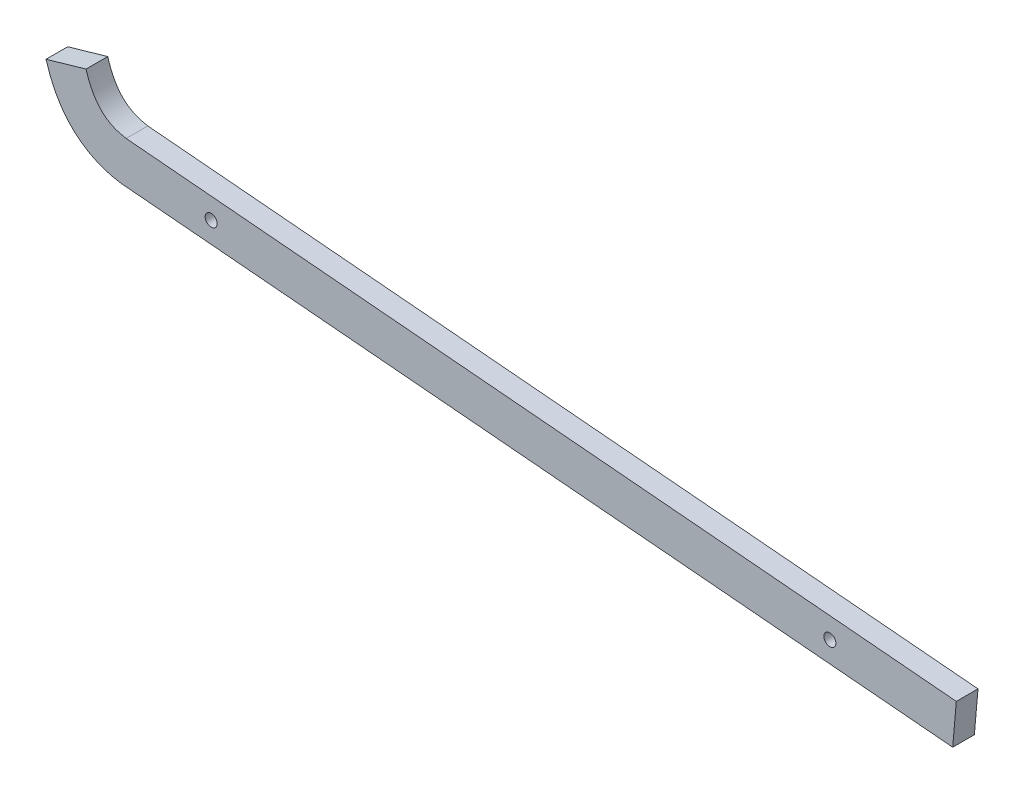
ISO-10303-21;
HEADER;
FILE_DESCRIPTION(('STEP AP214'),'2;1');
FILE_NAME('part.step','',(''),(''),'','','');
FILE_SCHEMA(('AUTOMOTIVE_DESIGN { 1 0 10303 214 1 1 1 1 }'));
ENDSEC;
DATA;
#1=APPLICATION_CONTEXT('core data for automotive mechanical design processes');
#2=APPLICATION_PROTOCOL_DEFINITION('international standard','automotive_design',2000,#1);
#3=PRODUCT_CONTEXT('',#1,'mechanical');
#4=PRODUCT('Part','Part','',(#3));
#5=PRODUCT_RELATED_PRODUCT_CATEGORY('part','',(#4));
#6=PRODUCT_DEFINITION_FORMATION('','',#4);
#7=PRODUCT_DEFINITION_CONTEXT('part definition',#1,'design');
#8=PRODUCT_DEFINITION('design','',#6,#7);
#9=PRODUCT_DEFINITION_SHAPE('','',#8);
#10=(LENGTH_UNIT() NAMED_UNIT(*) SI_UNIT(.MILLI.,.METRE.));
#11=(NAMED_UNIT(*) PLANE_ANGLE_UNIT() SI_UNIT($,.RADIAN.));
#12=(NAMED_UNIT(*) SI_UNIT($,.STERADIAN.) SOLID_ANGLE_UNIT());
#13=UNCERTAINTY_MEASURE_WITH_UNIT(LENGTH_MEASURE(1.E-05),#10,'distance_accuracy_value','');
#14=(GEOMETRIC_REPRESENTATION_CONTEXT(3) GLOBAL_UNCERTAINTY_ASSIGNED_CONTEXT((#13)) GLOBAL_UNIT_ASSIGNED_CONTEXT((#10,
#11,#12)) REPRESENTATION_CONTEXT('',''));
#15=CARTESIAN_POINT('',(0.,0.,0.));
#16=DIRECTION('',(0.,0.,1.));
#17=DIRECTION('',(1.,0.,0.));
#18=AXIS2_PLACEMENT_3D('',#15,#16,#17);
#19=CARTESIAN_POINT('',(-6.10087324066319,-1.76120575213683,6.604));
#20=CARTESIAN_POINT('',(-5.89459241992773,-2.47576913450151,6.604));
#21=CARTESIAN_POINT('',(-5.44269568601322,-3.90584224646754,6.604));
#22=CARTESIAN_POINT('',(-4.41722503602886,-6.62638985012359,6.604));
#23=CARTESIAN_POINT('',(-2.8776427544143,-9.82716434192923,6.604));
#24=CARTESIAN_POINT('',(-0.591083481702736,-13.2965983283422,6.604));
#25=CARTESIAN_POINT('',(3.06559007191318,-17.3627651422778,6.604));
#26=CARTESIAN_POINT('',(7.60319740215101,-20.4241500106264,6.604));
#27=CARTESIAN_POINT('',(12.1100045189791,-22.0722072749276,6.604));
#28=CARTESIAN_POINT('',(14.454118770747,-22.6477677650458,6.604));
#29=CARTESIAN_POINT('',(15.6616073425961,-22.8771505473728,6.604));
#30=CARTESIAN_POINT('',(16.2528048964055,-22.9745742974431,6.604));
#31=CARTESIAN_POINT('',(16.6211029033767,-23.0301063026709,6.604));
#32=CARTESIAN_POINT('',(16.7512627366436,-23.0488778316503,6.604));
#33=CARTESIAN_POINT('',(16.8230925388345,-23.0593794311307,6.604));
#34=B_SPLINE_CURVE_WITH_KNOTS('',3,(#19,#20,#21,#22,#23,#24,#25,#26,#27,#28,#29,#30,#31,#32,
#33),.UNSPECIFIED.,.F.,.F.,(4,1,1,1,1,1,1,1,1,1,1,1,4),(0.,0.062929815608461,0.125859631216922,
0.251719262433844,0.377578893650766,0.503438524867688,0.755157787301532,0.881017418518454,
0.943947234126915,0.975412141931146,0.991144595833261,0.999010822784319,1.00687704973538),.UNSPECIFIED.);
#35=DIRECTION('',(0.,0.,-1.));
#36=VECTOR('',#35,1.);
#37=SURFACE_OF_LINEAR_EXTRUSION('',#34,#36);
#38=CARTESIAN_POINT('',(-6.10087324066319,-1.76120575213683,0.));
#39=CARTESIAN_POINT('',(-5.89459241992773,-2.47576913450151,0.));
#40=CARTESIAN_POINT('',(-5.44269568601322,-3.90584224646754,0.));
#41=CARTESIAN_POINT('',(-4.41722503602886,-6.62638985012359,0.));
#42=CARTESIAN_POINT('',(-2.8776427544143,-9.82716434192923,0.));
#43=CARTESIAN_POINT('',(-0.591083481702736,-13.2965983283422,0.));
#44=CARTESIAN_POINT('',(3.06559007191318,-17.3627651422778,0.));
#45=CARTESIAN_POINT('',(7.60319740215101,-20.4241500106264,0.));
#46=CARTESIAN_POINT('',(12.1100045189791,-22.0722072749276,0.));
#47=CARTESIAN_POINT('',(14.454118770747,-22.6477677650458,0.));
#48=CARTESIAN_POINT('',(15.6616073425961,-22.8771505473728,0.));
#49=CARTESIAN_POINT('',(16.2528048964055,-22.9745742974431,0.));
#50=CARTESIAN_POINT('',(16.6211029033767,-23.0301063026709,0.));
#51=CARTESIAN_POINT('',(16.7512627366436,-23.0488778316503,0.));
#52=CARTESIAN_POINT('',(16.8230925388345,-23.0593794311307,0.));
#53=B_SPLINE_CURVE_WITH_KNOTS('',3,(#38,#39,#40,#41,#42,#43,#44,#45,#46,#47,#48,#49,#50,#51,
#52),.UNSPECIFIED.,.F.,.F.,(4,1,1,1,1,1,1,1,1,1,1,1,4),(0.,0.062929815608461,0.125859631216922,
0.251719262433844,0.377578893650766,0.503438524867688,0.755157787301532,0.881017418518454,
0.943947234126915,0.975412141931146,0.991144595833261,0.999010822784319,1.00687704973538),.UNSPECIFIED.);
#54=CARTESIAN_POINT('',(-6.10087324066319,-1.76120575213683,0.));
#55=VERTEX_POINT('',#54);
#56=CARTESIAN_POINT('',(16.8230925388345,-23.0593794311307,0.));
#57=VERTEX_POINT('',#56);
#58=EDGE_CURVE('E162',#55,#57,#53,.T.);
#59=ORIENTED_EDGE('',*,*,#58,.T.);
#60=DIRECTION('',(0.,0.,-1.));
#61=VECTOR('',#60,1.);
#62=CARTESIAN_POINT('',(16.8230925388345,-23.0593794311307,6.604));
#63=LINE('',#62,#61);
#64=CARTESIAN_POINT('',(16.8230925388345,-23.0593794311307,6.604));
#65=VERTEX_POINT('',#64);
#66=EDGE_CURVE('E11',#65,#57,#63,.T.);
#67=ORIENTED_EDGE('',*,*,#66,.F.);
#68=CARTESIAN_POINT('',(-6.10087324066319,-1.76120575213683,6.604));
#69=VERTEX_POINT('',#68);
#70=EDGE_CURVE('E181',#69,#65,#34,.T.);
#71=ORIENTED_EDGE('',*,*,#70,.F.);
#72=DIRECTION('',(0.,0.,-1.));
#73=VECTOR('',#72,1.);
#74=CARTESIAN_POINT('',(-6.10087324066319,-1.76120575213683,6.604));
#75=LINE('',#74,#73);
#76=EDGE_CURVE('E126',#69,#55,#75,.T.);
#77=ORIENTED_EDGE('',*,*,#76,.T.);
#78=EDGE_LOOP('',(#59,#67,#71,#77));
#79=FACE_BOUND('',#78,.T.);
#80=ADVANCED_FACE('F39',(#79),#37,.F.);
#81=CARTESIAN_POINT('',(16.8230925388345,-23.0593794311307,6.604));
#82=DIRECTION('',(0.0869193350521244,0.996215352819909,0.));
#83=DIRECTION('',(-0.996215352819909,0.0869193350521244,0.));
#84=AXIS2_PLACEMENT_3D('',#81,#82,#83);
#85=PLANE('',#84);
#86=DIRECTION('',(0.996215352819909,-0.0869193350521243,0.));
#87=VECTOR('',#86,1.);
#88=CARTESIAN_POINT('',(16.8230925388345,-23.0593794311307,0.));
#89=LINE('',#88,#87);
#90=CARTESIAN_POINT('',(270.045750863066,-45.1529408477177,0.));
#91=VERTEX_POINT('',#90);
#92=EDGE_CURVE('E153',#57,#91,#89,.T.);
#93=ORIENTED_EDGE('',*,*,#92,.T.);
#94=DIRECTION('',(0.,0.,-1.));
#95=VECTOR('',#94,1.);
#96=CARTESIAN_POINT('',(270.045750863066,-45.1529408477177,6.604));
#97=LINE('',#96,#95);
#98=CARTESIAN_POINT('',(270.045750863066,-45.1529408477177,6.604));
#99=VERTEX_POINT('',#98);
#100=EDGE_CURVE('E50',#99,#91,#97,.T.);
#101=ORIENTED_EDGE('',*,*,#100,.F.);
#102=DIRECTION('',(0.996215352819909,-0.0869193350521243,0.));
#103=VECTOR('',#102,1.);
#104=CARTESIAN_POINT('',(16.8230925388345,-23.0593794311307,6.604));
#105=LINE('',#104,#103);
#106=EDGE_CURVE('E95',#65,#99,#105,.T.);
#107=ORIENTED_EDGE('',*,*,#106,.F.);
#108=ORIENTED_EDGE('',*,*,#66,.T.);
#109=EDGE_LOOP('',(#93,#101,#107,#108));
#110=FACE_BOUND('',#109,.T.);
#111=ADVANCED_FACE('F146',(#110),#85,.F.);
#112=CARTESIAN_POINT('',(271.149626418228,-32.5010058669048,6.604));
#113=DIRECTION('',(-0.996215352819909,0.0869193350521262,0.));
#114=DIRECTION('',(-0.0869193350521263,-0.996215352819909,0.));
#115=AXIS2_PLACEMENT_3D('',#112,#113,#114);
#116=PLANE('',#115);
#117=DIRECTION('',(0.0869193350521263,0.996215352819909,0.));
#118=VECTOR('',#117,1.);
#119=CARTESIAN_POINT('',(271.149626418228,-32.5010058669048,0.));
#120=LINE('',#119,#118);
#121=CARTESIAN_POINT('',(271.149626418228,-32.5010058669048,0.));
#122=VERTEX_POINT('',#121);
#123=EDGE_CURVE('E161',#91,#122,#120,.T.);
#124=ORIENTED_EDGE('',*,*,#123,.T.);
#125=DIRECTION('',(0.,0.,-1.));
#126=VECTOR('',#125,1.);
#127=CARTESIAN_POINT('',(271.149626418228,-32.5010058669048,6.604));
#128=LINE('',#127,#126);
#129=CARTESIAN_POINT('',(271.149626418228,-32.5010058669048,6.604));
#130=VERTEX_POINT('',#129);
#131=EDGE_CURVE('E119',#130,#122,#128,.T.);
#132=ORIENTED_EDGE('',*,*,#131,.F.);
#133=DIRECTION('',(0.0869193350521263,0.996215352819909,0.));
#134=VECTOR('',#133,1.);
#135=CARTESIAN_POINT('',(271.149626418228,-32.5010058669048,6.604));
#136=LINE('',#135,#134);
#137=EDGE_CURVE('E108',#99,#130,#136,.T.);
#138=ORIENTED_EDGE('',*,*,#137,.F.);
#139=ORIENTED_EDGE('',*,*,#100,.T.);
#140=EDGE_LOOP('',(#124,#132,#138,#139));
#141=FACE_BOUND('',#140,.T.);
#142=ADVANCED_FACE('F144',(#141),#116,.F.);
#143=CARTESIAN_POINT('',(18.3080019680712,-10.4406894820002,6.604));
#144=DIRECTION('',(-0.0869193350521244,-0.996215352819909,0.));
#145=DIRECTION('',(0.996215352819909,-0.0869193350521244,0.));
#146=AXIS2_PLACEMENT_3D('',#143,#144,#145);
#147=PLANE('',#146);
#148=DIRECTION('',(-0.996215352819909,0.0869193350521244,0.));
#149=VECTOR('',#148,1.);
#150=CARTESIAN_POINT('',(18.3080019680712,-10.4406894820002,0.));
#151=LINE('',#150,#149);
#152=CARTESIAN_POINT('',(18.3080019680712,-10.4406894820002,0.));
#153=VERTEX_POINT('',#152);
#154=EDGE_CURVE('E117',#122,#153,#151,.T.);
#155=ORIENTED_EDGE('',*,*,#154,.T.);
#156=DIRECTION('',(0.,0.,-1.));
#157=VECTOR('',#156,1.);
#158=CARTESIAN_POINT('',(18.3080019680712,-10.4406894820002,6.604));
#159=LINE('',#158,#157);
#160=CARTESIAN_POINT('',(18.3080019680712,-10.4406894820002,6.604));
#161=VERTEX_POINT('',#160);
#162=EDGE_CURVE('E114',#161,#153,#159,.T.);
#163=ORIENTED_EDGE('',*,*,#162,.F.);
#164=DIRECTION('',(-0.996215352819909,0.0869193350521244,0.));
#165=VECTOR('',#164,1.);
#166=CARTESIAN_POINT('',(18.3080019680712,-10.4406894820002,6.604));
#167=LINE('',#166,#165);
#168=EDGE_CURVE('E102',#130,#161,#167,.T.);
#169=ORIENTED_EDGE('',*,*,#168,.F.);
#170=ORIENTED_EDGE('',*,*,#131,.T.);
#171=EDGE_LOOP('',(#155,#163,#169,#170));
#172=FACE_BOUND('',#171,.T.);
#173=ADVANCED_FACE('F115',(#172),#147,.F.);
#174=CARTESIAN_POINT('',(18.3080019680712,-10.4406894820002,6.604));
#175=CARTESIAN_POINT('',(17.9118212114692,-10.379141676815,6.604));
#176=CARTESIAN_POINT('',(17.1059209146753,-10.2265904408987,6.604));
#177=CARTESIAN_POINT('',(15.6563693669101,-9.84408726595655,6.604));
#178=CARTESIAN_POINT('',(14.0316347840266,-9.21521408683878,6.604));
#179=CARTESIAN_POINT('',(12.3458169884477,-8.23527919817691,6.604));
#180=CARTESIAN_POINT('',(10.8391059845239,-7.00109828024628,6.604));
#181=CARTESIAN_POINT('',(9.4595970240103,-5.45159195497398,6.604));
#182=CARTESIAN_POINT('',(8.1918566861666,-3.52103127753425,6.604));
#183=CARTESIAN_POINT('',(7.23978218699172,-1.54171431871191,6.604));
#184=CARTESIAN_POINT('',(6.56202962287323,0.258197331959122,6.604));
#185=CARTESIAN_POINT('',(6.24399872176819,1.26541449284123,6.604));
#186=CARTESIAN_POINT('',(6.10087324066319,1.76120575213683,6.604));
#187=B_SPLINE_CURVE_WITH_KNOTS('',3,(#174,#175,#176,#177,#178,#179,#180,#181,#182,#183,#184,
#185,#186),.UNSPECIFIED.,.F.,.F.,(4,1,1,1,1,1,1,1,1,1,4),(0.,0.0619673291670654,
0.123934658334131,0.247869316668262,0.371803975002393,0.495738633336523,0.619673291670654,
0.743607950004785,0.867542608338916,0.929509937505981,0.991477266673047),.UNSPECIFIED.);
#188=DIRECTION('',(0.,0.,-1.));
#189=VECTOR('',#188,1.);
#190=SURFACE_OF_LINEAR_EXTRUSION('',#187,#189);
#191=CARTESIAN_POINT('',(18.3080019680712,-10.4406894820002,0.));
#192=CARTESIAN_POINT('',(17.9118212114692,-10.379141676815,0.));
#193=CARTESIAN_POINT('',(17.1059209146753,-10.2265904408987,0.));
#194=CARTESIAN_POINT('',(15.6563693669101,-9.84408726595655,0.));
#195=CARTESIAN_POINT('',(14.0316347840266,-9.21521408683878,0.));
#196=CARTESIAN_POINT('',(12.3458169884477,-8.23527919817691,0.));
#197=CARTESIAN_POINT('',(10.8391059845239,-7.00109828024628,0.));
#198=CARTESIAN_POINT('',(9.4595970240103,-5.45159195497398,0.));
#199=CARTESIAN_POINT('',(8.1918566861666,-3.52103127753425,0.));
#200=CARTESIAN_POINT('',(7.23978218699172,-1.54171431871191,0.));
#201=CARTESIAN_POINT('',(6.56202962287323,0.258197331959122,0.));
#202=CARTESIAN_POINT('',(6.24399872176819,1.26541449284123,0.));
#203=CARTESIAN_POINT('',(6.10087324066319,1.76120575213683,0.));
#204=B_SPLINE_CURVE_WITH_KNOTS('',3,(#191,#192,#193,#194,#195,#196,#197,#198,#199,#200,#201,
#202,#203),.UNSPECIFIED.,.F.,.F.,(4,1,1,1,1,1,1,1,1,1,4),(0.,0.0619673291670654,
0.123934658334131,0.247869316668262,0.371803975002393,0.495738633336523,0.619673291670654,
0.743607950004785,0.867542608338916,0.929509937505981,0.991477266673047),.UNSPECIFIED.);
#205=CARTESIAN_POINT('',(6.10087324066319,1.76120575213683,0.));
#206=VERTEX_POINT('',#205);
#207=EDGE_CURVE('E81',#153,#206,#204,.T.);
#208=ORIENTED_EDGE('',*,*,#207,.T.);
#209=DIRECTION('',(0.,0.,-1.));
#210=VECTOR('',#209,1.);
#211=CARTESIAN_POINT('',(6.10087324066319,1.76120575213683,6.604));
#212=LINE('',#211,#210);
#213=CARTESIAN_POINT('',(6.10087324066319,1.76120575213683,6.604));
#214=VERTEX_POINT('',#213);
#215=EDGE_CURVE('E120',#214,#206,#212,.T.);
#216=ORIENTED_EDGE('',*,*,#215,.F.);
#217=EDGE_CURVE('E106',#161,#214,#187,.T.);
#218=ORIENTED_EDGE('',*,*,#217,.F.);
#219=ORIENTED_EDGE('',*,*,#162,.T.);
#220=EDGE_LOOP('',(#208,#216,#218,#219));
#221=FACE_BOUND('',#220,.T.);
#222=ADVANCED_FACE('F122',(#221),#190,.F.);
#223=CARTESIAN_POINT('',(-6.10087324066319,-1.76120575213683,6.604));
#224=DIRECTION('',(0.277355236556981,-0.960767439474518,0.));
#225=DIRECTION('',(0.960767439474518,0.277355236556981,0.));
#226=AXIS2_PLACEMENT_3D('',#223,#224,#225);
#227=PLANE('',#226);
#228=DIRECTION('',(-0.960767439474518,-0.277355236556981,0.));
#229=VECTOR('',#228,1.);
#230=CARTESIAN_POINT('',(-6.10087324066319,-1.76120575213683,0.));
#231=LINE('',#230,#229);
#232=EDGE_CURVE('E87',#206,#55,#231,.T.);
#233=ORIENTED_EDGE('',*,*,#232,.T.);
#234=ORIENTED_EDGE('',*,*,#76,.F.);
#235=DIRECTION('',(-0.960767439474518,-0.277355236556981,0.));
#236=VECTOR('',#235,1.);
#237=CARTESIAN_POINT('',(-6.10087324066319,-1.76120575213683,6.604));
#238=LINE('',#237,#236);
#239=EDGE_CURVE('E58',#214,#69,#238,.T.);
#240=ORIENTED_EDGE('',*,*,#239,.F.);
#241=ORIENTED_EDGE('',*,*,#215,.T.);
#242=EDGE_LOOP('',(#233,#234,#240,#241));
#243=FACE_BOUND('',#242,.T.);
#244=ADVANCED_FACE('F140',(#243),#227,.F.);
#245=CARTESIAN_POINT('',(2.22483283156103,-16.262491609995,6.604));
#246=DIRECTION('',(0.,0.,-1.));
#247=DIRECTION('',(-1.,0.,0.));
#248=AXIS2_PLACEMENT_3D('',#245,#246,#247);
#249=PLANE('',#248);
#250=CARTESIAN_POINT('',(44.2008732406632,-19.0739544977008,6.604));
#251=DIRECTION('',(0.,0.,1.));
#252=DIRECTION('',(1.,0.,0.));
#253=AXIS2_PLACEMENT_3D('',#250,#251,#252);
#254=CIRCLE('',#253,1.8288);
#255=CARTESIAN_POINT('',(46.0296732406632,-19.0739544977008,6.604));
#256=VERTEX_POINT('',#255);
#257=EDGE_CURVE('E215',#256,#256,#254,.T.);
#258=ORIENTED_EDGE('',*,*,#257,.F.);
#259=EDGE_LOOP('',(#258));
#260=FACE_BOUND('',#259,.T.);
#261=CARTESIAN_POINT('',(232.641883698209,-35.5153466918253,6.604));
#262=DIRECTION('',(0.,0.,1.));
#263=DIRECTION('',(1.,0.,0.));
#264=AXIS2_PLACEMENT_3D('',#261,#262,#263);
#265=CIRCLE('',#264,1.82879999999999);
#266=CARTESIAN_POINT('',(234.470683698209,-35.5153466918253,6.604));
#267=VERTEX_POINT('',#266);
#268=EDGE_CURVE('E191',#267,#267,#265,.T.);
#269=ORIENTED_EDGE('',*,*,#268,.F.);
#270=EDGE_LOOP('',(#269));
#271=FACE_BOUND('',#270,.T.);
#272=ORIENTED_EDGE('',*,*,#70,.T.);
#273=ORIENTED_EDGE('',*,*,#106,.T.);
#274=ORIENTED_EDGE('',*,*,#137,.T.);
#275=ORIENTED_EDGE('',*,*,#168,.T.);
#276=ORIENTED_EDGE('',*,*,#217,.T.);
#277=ORIENTED_EDGE('',*,*,#239,.T.);
#278=EDGE_LOOP('',(#272,#273,#274,#275,#276,#277));
#279=FACE_BOUND('',#278,.T.);
#280=ADVANCED_FACE('F104',(#260,#271,#279),#249,.F.);
#281=CARTESIAN_POINT('',(2.22483283156103,-16.262491609995,0.));
#282=DIRECTION('',(0.,0.,-1.));
#283=DIRECTION('',(-1.,0.,0.));
#284=AXIS2_PLACEMENT_3D('',#281,#282,#283);
#285=PLANE('',#284);
#286=CARTESIAN_POINT('',(44.2008732406632,-19.0739544977008,0.));
#287=DIRECTION('',(0.,0.,-1.));
#288=DIRECTION('',(-1.,0.,0.));
#289=AXIS2_PLACEMENT_3D('',#286,#287,#288);
#290=CIRCLE('',#289,1.8288);
#291=CARTESIAN_POINT('',(42.3720732406632,-19.0739544977008,0.));
#292=VERTEX_POINT('',#291);
#293=EDGE_CURVE('E43',#292,#292,#290,.T.);
#294=ORIENTED_EDGE('',*,*,#293,.F.);
#295=EDGE_LOOP('',(#294));
#296=FACE_BOUND('',#295,.T.);
#297=CARTESIAN_POINT('',(232.641883698209,-35.5153466918253,0.));
#298=DIRECTION('',(0.,0.,-1.));
#299=DIRECTION('',(-1.,0.,0.));
#300=AXIS2_PLACEMENT_3D('',#297,#298,#299);
#301=CIRCLE('',#300,1.82879999999999);
#302=CARTESIAN_POINT('',(230.813083698209,-35.5153466918253,0.));
#303=VERTEX_POINT('',#302);
#304=EDGE_CURVE('E188',#303,#303,#301,.T.);
#305=ORIENTED_EDGE('',*,*,#304,.F.);
#306=EDGE_LOOP('',(#305));
#307=FACE_BOUND('',#306,.T.);
#308=ORIENTED_EDGE('',*,*,#58,.F.);
#309=ORIENTED_EDGE('',*,*,#232,.F.);
#310=ORIENTED_EDGE('',*,*,#207,.F.);
#311=ORIENTED_EDGE('',*,*,#154,.F.);
#312=ORIENTED_EDGE('',*,*,#123,.F.);
#313=ORIENTED_EDGE('',*,*,#92,.F.);
#314=EDGE_LOOP('',(#308,#309,#310,#311,#312,#313));
#315=FACE_BOUND('',#314,.T.);
#316=ADVANCED_FACE('F166',(#296,#307,#315),#285,.T.);
#317=CARTESIAN_POINT('',(232.641883698209,-35.5153466918253,6.604));
#318=DIRECTION('',(0.,0.,1.));
#319=DIRECTION('',(1.,0.,0.));
#320=AXIS2_PLACEMENT_3D('',#317,#318,#319);
#321=CYLINDRICAL_SURFACE('',#320,1.82879999999999);
#322=ORIENTED_EDGE('',*,*,#304,.T.);
#323=EDGE_LOOP('',(#322));
#324=FACE_BOUND('',#323,.T.);
#325=ORIENTED_EDGE('',*,*,#268,.T.);
#326=EDGE_LOOP('',(#325));
#327=FACE_BOUND('',#326,.T.);
#328=ADVANCED_FACE('F228',(#324,#327),#321,.F.);
#329=CARTESIAN_POINT('',(44.2008732406632,-19.0739544977008,6.604));
#330=DIRECTION('',(0.,0.,1.));
#331=DIRECTION('',(1.,0.,0.));
#332=AXIS2_PLACEMENT_3D('',#329,#330,#331);
#333=CYLINDRICAL_SURFACE('',#332,1.8288);
#334=ORIENTED_EDGE('',*,*,#293,.T.);
#335=EDGE_LOOP('',(#334));
#336=FACE_BOUND('',#335,.T.);
#337=ORIENTED_EDGE('',*,*,#257,.T.);
#338=EDGE_LOOP('',(#337));
#339=FACE_BOUND('',#338,.T.);
#340=ADVANCED_FACE('F224',(#336,#339),#333,.F.);
#341=CLOSED_SHELL('',(#80,#111,#142,#173,#222,#244,#280,#316,#328,#340));
#342=MANIFOLD_SOLID_BREP('B2',#341);
#343=ADVANCED_BREP_SHAPE_REPRESENTATION('',(#18,#342),#14);
#344=SHAPE_DEFINITION_REPRESENTATION(#9,#343);
ENDSEC;
END-ISO-10303-21;
